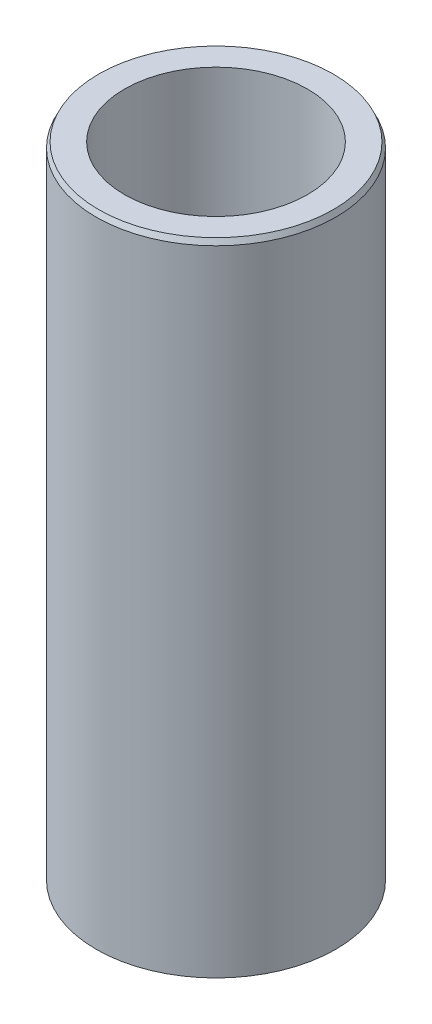
ISO-10303-21;
HEADER;
FILE_DESCRIPTION(('STEP AP214'),'2;1');
FILE_NAME('part.step','',(''),(''),'','','');
FILE_SCHEMA(('AUTOMOTIVE_DESIGN { 1 0 10303 214 1 1 1 1 }'));
ENDSEC;
DATA;
#1=APPLICATION_CONTEXT('core data for automotive mechanical design processes');
#2=APPLICATION_PROTOCOL_DEFINITION('international standard','automotive_design',2000,#1);
#3=PRODUCT_CONTEXT('',#1,'mechanical');
#4=PRODUCT('Part','Part','',(#3));
#5=PRODUCT_RELATED_PRODUCT_CATEGORY('part','',(#4));
#6=PRODUCT_DEFINITION_FORMATION('','',#4);
#7=PRODUCT_DEFINITION_CONTEXT('part definition',#1,'design');
#8=PRODUCT_DEFINITION('design','',#6,#7);
#9=PRODUCT_DEFINITION_SHAPE('','',#8);
#10=(LENGTH_UNIT() NAMED_UNIT(*) SI_UNIT(.MILLI.,.METRE.));
#11=(NAMED_UNIT(*) PLANE_ANGLE_UNIT() SI_UNIT($,.RADIAN.));
#12=(NAMED_UNIT(*) SI_UNIT($,.STERADIAN.) SOLID_ANGLE_UNIT());
#13=UNCERTAINTY_MEASURE_WITH_UNIT(LENGTH_MEASURE(1.E-05),#10,'distance_accuracy_value','');
#14=(GEOMETRIC_REPRESENTATION_CONTEXT(3) GLOBAL_UNCERTAINTY_ASSIGNED_CONTEXT((#13)) GLOBAL_UNIT_ASSIGNED_CONTEXT((#10,
#11,#12)) REPRESENTATION_CONTEXT('',''));
#15=CARTESIAN_POINT('',(0.,0.,0.));
#16=DIRECTION('',(0.,0.,1.));
#17=DIRECTION('',(1.,0.,0.));
#18=AXIS2_PLACEMENT_3D('',#15,#16,#17);
#19=CARTESIAN_POINT('',(0.,214.181819222892,0.));
#20=DIRECTION('',(0.,-1.,0.));
#21=DIRECTION('',(0.,0.,-1.));
#22=AXIS2_PLACEMENT_3D('',#19,#20,#21);
#23=CYLINDRICAL_SURFACE('',#22,40.);
#24=CARTESIAN_POINT('',(0.,212.414805123135,0.));
#25=DIRECTION('',(0.,1.,0.));
#26=DIRECTION('',(0.,0.,1.));
#27=AXIS2_PLACEMENT_3D('',#24,#25,#26);
#28=CIRCLE('',#27,40.);
#29=CARTESIAN_POINT('',(0.,212.414805123135,-40.));
#30=VERTEX_POINT('',#29);
#31=EDGE_CURVE('E50',#30,#30,#28,.F.);
#32=CARTESIAN_POINT('',(0.,0.837243441805524,0.));
#33=DIRECTION('',(0.,1.,0.));
#34=DIRECTION('',(0.,0.,1.));
#35=AXIS2_PLACEMENT_3D('',#32,#33,#34);
#36=CIRCLE('',#35,40.);
#37=CARTESIAN_POINT('',(0.,0.837243441805496,-40.));
#38=VERTEX_POINT('',#37);
#39=EDGE_CURVE('E51',#38,#38,#36,.T.);
#40=CARTESIAN_POINT('',(0.,212.414805123135,-40.));
#41=CARTESIAN_POINT('',(0.,210.210872188955,-40.));
#42=CARTESIAN_POINT('',(0.,208.006939254774,-40.));
#43=CARTESIAN_POINT('',(0.,203.599073386413,-40.));
#44=CARTESIAN_POINT('',(0.,201.395140452233,-40.));
#45=CARTESIAN_POINT('',(0.,196.987274583872,-40.));
#46=CARTESIAN_POINT('',(0.,194.783341649691,-40.));
#47=CARTESIAN_POINT('',(0.,190.37547578133,-40.));
#48=CARTESIAN_POINT('',(0.,188.17154284715,-40.));
#49=CARTESIAN_POINT('',(0.,183.763676978789,-40.));
#50=CARTESIAN_POINT('',(0.,181.559744044608,-40.));
#51=CARTESIAN_POINT('',(0.,177.151878176247,-40.));
#52=CARTESIAN_POINT('',(0.,174.947945242066,-40.));
#53=CARTESIAN_POINT('',(0.,170.540079373705,-40.));
#54=CARTESIAN_POINT('',(0.,168.336146439525,-40.));
#55=CARTESIAN_POINT('',(0.,163.928280571164,-40.));
#56=CARTESIAN_POINT('',(0.,161.724347636983,-40.));
#57=CARTESIAN_POINT('',(0.,157.316481768622,-40.));
#58=CARTESIAN_POINT('',(0.,155.112548834442,-40.));
#59=CARTESIAN_POINT('',(0.,150.704682966081,-40.));
#60=CARTESIAN_POINT('',(0.,148.5007500319,-40.));
#61=CARTESIAN_POINT('',(0.,144.092884163539,-40.));
#62=CARTESIAN_POINT('',(0.,141.888951229359,-40.));
#63=CARTESIAN_POINT('',(0.,137.481085360998,-40.));
#64=CARTESIAN_POINT('',(0.,135.277152426817,-40.));
#65=CARTESIAN_POINT('',(0.,130.869286558456,-40.));
#66=CARTESIAN_POINT('',(0.,128.665353624276,-40.));
#67=CARTESIAN_POINT('',(0.,124.257487755915,-40.));
#68=CARTESIAN_POINT('',(0.,122.053554821734,-40.));
#69=CARTESIAN_POINT('',(0.,117.645688953373,-40.));
#70=CARTESIAN_POINT('',(0.,115.441756019192,-40.));
#71=CARTESIAN_POINT('',(0.,111.033890150831,-40.));
#72=CARTESIAN_POINT('',(0.,108.829957216651,-40.));
#73=CARTESIAN_POINT('',(0.,104.42209134829,-40.));
#74=CARTESIAN_POINT('',(0.,102.218158414109,-40.));
#75=CARTESIAN_POINT('',(0.,97.8102925457483,-40.));
#76=CARTESIAN_POINT('',(0.,95.6063596115678,-40.));
#77=CARTESIAN_POINT('',(0.,91.1984937432068,-40.));
#78=CARTESIAN_POINT('',(0.,88.9945608090263,-40.));
#79=CARTESIAN_POINT('',(0.,84.5866949406652,-40.));
#80=CARTESIAN_POINT('',(0.,82.3827620064847,-40.));
#81=CARTESIAN_POINT('',(0.,77.9748961381236,-40.));
#82=CARTESIAN_POINT('',(0.,75.7709632039431,-40.));
#83=CARTESIAN_POINT('',(0.,71.3630973355821,-40.));
#84=CARTESIAN_POINT('',(0.,69.1591644014016,-40.));
#85=CARTESIAN_POINT('',(0.,64.7512985330405,-40.));
#86=CARTESIAN_POINT('',(0.,62.54736559886,-40.));
#87=CARTESIAN_POINT('',(0.,58.139499730499,-40.));
#88=CARTESIAN_POINT('',(0.,55.9355667963185,-40.));
#89=CARTESIAN_POINT('',(0.,51.5277009279574,-40.));
#90=CARTESIAN_POINT('',(0.,49.3237679937769,-40.));
#91=CARTESIAN_POINT('',(0.,44.9159021254158,-40.));
#92=CARTESIAN_POINT('',(0.,42.7119691912353,-40.));
#93=CARTESIAN_POINT('',(0.,38.3041033228743,-40.));
#94=CARTESIAN_POINT('',(0.,36.1001703886938,-40.));
#95=CARTESIAN_POINT('',(0.,31.6923045203328,-40.));
#96=CARTESIAN_POINT('',(0.,29.4883715861522,-40.));
#97=CARTESIAN_POINT('',(0.,25.0805057177912,-40.));
#98=CARTESIAN_POINT('',(0.,22.8765727836107,-40.));
#99=CARTESIAN_POINT('',(0.,18.4687069152496,-40.));
#100=CARTESIAN_POINT('',(0.,16.2647739810691,-40.));
#101=CARTESIAN_POINT('',(0.,11.8569081127081,-40.));
#102=CARTESIAN_POINT('',(0.,9.65297517852756,-40.));
#103=CARTESIAN_POINT('',(0.,5.24510931016652,-40.));
#104=CARTESIAN_POINT('',(0.,3.04117637598601,-40.));
#105=CARTESIAN_POINT('',(0.,0.837243441805496,-40.));
#106=B_SPLINE_CURVE_WITH_KNOTS('',3,(#40,#41,#42,#43,#44,#45,#46,#47,#48,#49,#50,#51,#52,#53,
#54,#55,#56,#57,#58,#59,#60,#61,#62,#63,#64,#65,#66,#67,#68,#69,#70,#71,#72,#73,#74,#75,#76,#77,
#78,#79,#80,#81,#82,#83,#84,#85,#86,#87,#88,#89,#90,#91,#92,#93,#94,#95,#96,#97,#98,#99,#100,
#101,#102,#103,#104,#105),.UNSPECIFIED.,.F.,.F.,(4,2,2,2,2,2,2,2,2,2,2,2,2,2,2,2,2,2,2,2,2,2,2,
2,2,2,2,2,2,2,2,2,4),(0.,6.61179880254154,13.2235976050831,19.8353964076247,26.4471952101662,
33.0589940127078,39.6707928152493,46.2825916177909,52.8943904203324,59.506189222874,
66.1179880254155,72.7297868279571,79.3415856304986,85.9533844330402,92.5651832355818,
99.1769820381233,105.788780840665,112.400579643206,119.012378445748,125.62417724829,
132.235976050831,138.847774853373,145.459573655914,152.071372458456,158.683171260997,
165.294970063539,171.90676886608,178.518567668622,185.130366471164,191.742165273705,
198.353964076247,204.965762878788,211.57756168133),.UNSPECIFIED.);
#107=EDGE_CURVE('BSEAM39',#30,#38,#106,.T.);
#108=ORIENTED_EDGE('',*,*,#31,.T.);
#109=ORIENTED_EDGE('',*,*,#39,.T.);
#110=ORIENTED_EDGE('',*,*,#107,.T.);
#111=ORIENTED_EDGE('',*,*,#107,.F.);
#112=EDGE_LOOP('',(#108,#110,#109,#111));
#113=FACE_BOUND('',#112,.T.);
#114=ADVANCED_FACE('F39',(#113),#23,.T.);
#115=CARTESIAN_POINT('',(0.,214.181819222892,0.));
#116=DIRECTION('',(0.,1.,0.));
#117=DIRECTION('',(0.,0.,1.));
#118=AXIS2_PLACEMENT_3D('',#115,#116,#117);
#119=PLANE('',#118);
#120=CARTESIAN_POINT('',(0.,214.181819222892,0.));
#121=DIRECTION('',(0.,1.,0.));
#122=DIRECTION('',(0.,0.,1.));
#123=AXIS2_PLACEMENT_3D('',#120,#121,#122);
#124=CIRCLE('',#123,39.1627565581945);
#125=CARTESIAN_POINT('',(0.,214.181819222892,-39.1627565581945));
#126=VERTEX_POINT('',#125);
#127=EDGE_CURVE('E54',#126,#126,#124,.T.);
#128=ORIENTED_EDGE('',*,*,#127,.T.);
#129=EDGE_LOOP('',(#128));
#130=FACE_BOUND('',#129,.T.);
#131=CARTESIAN_POINT('',(0.,214.181819222892,0.));
#132=DIRECTION('',(0.,1.,0.));
#133=DIRECTION('',(0.,0.,1.));
#134=AXIS2_PLACEMENT_3D('',#131,#132,#133);
#135=CIRCLE('',#134,30.5337152752213);
#136=CARTESIAN_POINT('',(0.,214.181819222892,30.5337152752213));
#137=VERTEX_POINT('',#136);
#138=EDGE_CURVE('E58',#137,#137,#135,.T.);
#139=ORIENTED_EDGE('',*,*,#138,.F.);
#140=EDGE_LOOP('',(#139));
#141=FACE_BOUND('',#140,.T.);
#142=ADVANCED_FACE('F69',(#130,#141),#119,.T.);
#143=CARTESIAN_POINT('',(0.,0.,0.));
#144=DIRECTION('',(0.,1.,0.));
#145=DIRECTION('',(0.,0.,1.));
#146=AXIS2_PLACEMENT_3D('',#143,#144,#145);
#147=PLANE('',#146);
#148=CARTESIAN_POINT('',(0.,0.,0.));
#149=DIRECTION('',(0.,1.,0.));
#150=DIRECTION('',(0.,0.,1.));
#151=AXIS2_PLACEMENT_3D('',#148,#149,#150);
#152=CIRCLE('',#151,38.2329859002427);
#153=CARTESIAN_POINT('',(0.,0.,38.2329859002427));
#154=VERTEX_POINT('',#153);
#155=EDGE_CURVE('E10',#154,#154,#152,.F.);
#156=ORIENTED_EDGE('',*,*,#155,.T.);
#157=EDGE_LOOP('',(#156));
#158=FACE_BOUND('',#157,.T.);
#159=CARTESIAN_POINT('',(0.,0.,0.));
#160=DIRECTION('',(0.,1.,0.));
#161=DIRECTION('',(0.,0.,1.));
#162=AXIS2_PLACEMENT_3D('',#159,#160,#161);
#163=CIRCLE('',#162,30.5337152752213);
#164=CARTESIAN_POINT('',(0.,0.,30.5337152752213));
#165=VERTEX_POINT('',#164);
#166=EDGE_CURVE('E63',#165,#165,#163,.T.);
#167=ORIENTED_EDGE('',*,*,#166,.T.);
#168=EDGE_LOOP('',(#167));
#169=FACE_BOUND('',#168,.T.);
#170=ADVANCED_FACE('F75',(#158,#169),#147,.F.);
#171=CARTESIAN_POINT('',(0.,214.181819222892,0.));
#172=DIRECTION('',(0.,-1.,0.));
#173=DIRECTION('',(0.,0.,-1.));
#174=AXIS2_PLACEMENT_3D('',#171,#172,#173);
#175=CYLINDRICAL_SURFACE('',#174,30.5337152752213);
#176=ORIENTED_EDGE('',*,*,#138,.T.);
#177=EDGE_LOOP('',(#176));
#178=FACE_BOUND('',#177,.T.);
#179=ORIENTED_EDGE('',*,*,#166,.F.);
#180=EDGE_LOOP('',(#179));
#181=FACE_BOUND('',#180,.T.);
#182=ADVANCED_FACE('F70',(#178,#181),#175,.F.);
#183=CARTESIAN_POINT('',(0.,214.181819222892,0.));
#184=DIRECTION('',(0.,-1.,0.));
#185=DIRECTION('',(0.,0.,-1.));
#186=AXIS2_PLACEMENT_3D('',#183,#184,#185);
#187=CONICAL_SURFACE('',#186,39.1627565581945,0.442483652923637);
#188=CARTESIAN_POINT('',(0.,212.414805123135,-40.));
#189=CARTESIAN_POINT('',(0.,212.433211520008,-39.9912787141479));
#190=CARTESIAN_POINT('',(0.,212.45161791688,-39.9825574282957));
#191=CARTESIAN_POINT('',(0.,212.488430710625,-39.9651148565914));
#192=CARTESIAN_POINT('',(0.,212.506837107498,-39.9563935707393));
#193=CARTESIAN_POINT('',(0.,212.543649901243,-39.938950999035));
#194=CARTESIAN_POINT('',(0.,212.562056298115,-39.9302297131829));
#195=CARTESIAN_POINT('',(0.,212.59886909186,-39.9127871414786));
#196=CARTESIAN_POINT('',(0.,212.617275488732,-39.9040658556265));
#197=CARTESIAN_POINT('',(0.,212.654088282477,-39.8866232839222));
#198=CARTESIAN_POINT('',(0.,212.67249467935,-39.87790199807));
#199=CARTESIAN_POINT('',(0.,212.709307473095,-39.8604594263658));
#200=CARTESIAN_POINT('',(0.,212.727713869967,-39.8517381405136));
#201=CARTESIAN_POINT('',(0.,212.764526663712,-39.8342955688093));
#202=CARTESIAN_POINT('',(0.,212.782933060585,-39.8255742829572));
#203=CARTESIAN_POINT('',(0.,212.81974585433,-39.8081317112529));
#204=CARTESIAN_POINT('',(0.,212.838152251202,-39.7994104254008));
#205=CARTESIAN_POINT('',(0.,212.874965044947,-39.7819678536965));
#206=CARTESIAN_POINT('',(0.,212.89337144182,-39.7732465678444));
#207=CARTESIAN_POINT('',(0.,212.930184235564,-39.7558039961401));
#208=CARTESIAN_POINT('',(0.,212.948590632437,-39.7470827102879));
#209=CARTESIAN_POINT('',(0.,212.985403426182,-39.7296401385837));
#210=CARTESIAN_POINT('',(0.,213.003809823054,-39.7209188527315));
#211=CARTESIAN_POINT('',(0.,213.040622616799,-39.7034762810272));
#212=CARTESIAN_POINT('',(0.,213.059029013672,-39.6947549951751));
#213=CARTESIAN_POINT('',(0.,213.095841807417,-39.6773124234708));
#214=CARTESIAN_POINT('',(0.,213.114248204289,-39.6685911376187));
#215=CARTESIAN_POINT('',(0.,213.151060998034,-39.6511485659144));
#216=CARTESIAN_POINT('',(0.,213.169467394907,-39.6424272800623));
#217=CARTESIAN_POINT('',(0.,213.206280188652,-39.624984708358));
#218=CARTESIAN_POINT('',(0.,213.224686585524,-39.6162634225058));
#219=CARTESIAN_POINT('',(0.,213.261499379269,-39.5988208508015));
#220=CARTESIAN_POINT('',(0.,213.279905776141,-39.5900995649494));
#221=CARTESIAN_POINT('',(0.,213.316718569886,-39.5726569932451));
#222=CARTESIAN_POINT('',(0.,213.335124966759,-39.563935707393));
#223=CARTESIAN_POINT('',(0.,213.371937760504,-39.5464931356887));
#224=CARTESIAN_POINT('',(0.,213.390344157376,-39.5377718498366));
#225=CARTESIAN_POINT('',(0.,213.427156951121,-39.5203292781323));
#226=CARTESIAN_POINT('',(0.,213.445563347994,-39.5116079922801));
#227=CARTESIAN_POINT('',(0.,213.482376141739,-39.4941654205759));
#228=CARTESIAN_POINT('',(0.,213.500782538611,-39.4854441347237));
#229=CARTESIAN_POINT('',(0.,213.537595332356,-39.4680015630194));
#230=CARTESIAN_POINT('',(0.,213.556001729228,-39.4592802771673));
#231=CARTESIAN_POINT('',(0.,213.592814522973,-39.441837705463));
#232=CARTESIAN_POINT('',(0.,213.611220919846,-39.4331164196109));
#233=CARTESIAN_POINT('',(0.,213.648033713591,-39.4156738479066));
#234=CARTESIAN_POINT('',(0.,213.666440110463,-39.4069525620545));
#235=CARTESIAN_POINT('',(0.,213.703252904208,-39.3895099903502));
#236=CARTESIAN_POINT('',(0.,213.721659301081,-39.380788704498));
#237=CARTESIAN_POINT('',(0.,213.758472094826,-39.3633461327938));
#238=CARTESIAN_POINT('',(0.,213.776878491698,-39.3546248469416));
#239=CARTESIAN_POINT('',(0.,213.813691285443,-39.3371822752373));
#240=CARTESIAN_POINT('',(0.,213.832097682316,-39.3284609893852));
#241=CARTESIAN_POINT('',(0.,213.86891047606,-39.3110184176809));
#242=CARTESIAN_POINT('',(0.,213.887316872933,-39.3022971318288));
#243=CARTESIAN_POINT('',(0.,213.924129666678,-39.2848545601245));
#244=CARTESIAN_POINT('',(0.,213.94253606355,-39.2761332742724));
#245=CARTESIAN_POINT('',(0.,213.979348857295,-39.2586907025681));
#246=CARTESIAN_POINT('',(0.,213.997755254168,-39.2499694167159));
#247=CARTESIAN_POINT('',(0.,214.034568047913,-39.2325268450117));
#248=CARTESIAN_POINT('',(0.,214.052974444785,-39.2238055591595));
#249=CARTESIAN_POINT('',(0.,214.08978723853,-39.2063629874552));
#250=CARTESIAN_POINT('',(0.,214.108193635403,-39.1976417016031));
#251=CARTESIAN_POINT('',(0.,214.145006429148,-39.1801991298988));
#252=CARTESIAN_POINT('',(0.,214.16341282602,-39.1714778440467));
#253=CARTESIAN_POINT('',(0.,214.181819222892,-39.1627565581945));
#254=B_SPLINE_CURVE_WITH_KNOTS('',3,(#188,#189,#190,#191,#192,#193,#194,#195,#196,#197,#198,
#199,#200,#201,#202,#203,#204,#205,#206,#207,#208,#209,#210,#211,#212,#213,#214,#215,#216,#217,
#218,#219,#220,#221,#222,#223,#224,#225,#226,#227,#228,#229,#230,#231,#232,#233,#234,#235,#236,
#237,#238,#239,#240,#241,#242,#243,#244,#245,#246,#247,#248,#249,#250,#251,#252,#253),
.UNSPECIFIED.,.F.,.F.,(4,2,2,2,2,2,2,2,2,2,2,2,2,2,2,2,2,2,2,2,2,2,2,2,2,2,2,2,2,2,2,2,4),(0.,
0.0611040625054855,0.122208125010968,0.183312187516454,0.244416250021961,0.305520312527447,
0.366624375032929,0.427728437538415,0.488832500043923,0.549936562549408,0.611040625054891,
0.672144687560376,0.733248750065884,0.794352812571369,0.855456875076852,0.916560937582338,
0.977665000087848,1.03876906259333,1.09987312509882,1.1609771876043,1.22208125010981,
1.28318531261529,1.34428937512078,1.40539343762626,1.46649750013177,1.52760156263725,
1.58870562514274,1.64980968764822,1.71091375015373,1.77201781265921,1.8331218751647,
1.89422593767019,1.95533000017569),.UNSPECIFIED.);
#255=EDGE_CURVE('BSEAM81',#30,#126,#254,.T.);
#256=ORIENTED_EDGE('',*,*,#31,.F.);
#257=ORIENTED_EDGE('',*,*,#127,.F.);
#258=ORIENTED_EDGE('',*,*,#255,.T.);
#259=ORIENTED_EDGE('',*,*,#255,.F.);
#260=EDGE_LOOP('',(#256,#258,#257,#259));
#261=FACE_BOUND('',#260,.T.);
#262=ADVANCED_FACE('F81',(#261),#187,.T.);
#263=CARTESIAN_POINT('',(0.,0.837243441805524,0.));
#264=DIRECTION('',(0.,1.,0.));
#265=DIRECTION('',(0.,0.,1.));
#266=AXIS2_PLACEMENT_3D('',#263,#264,#265);
#267=CONICAL_SURFACE('',#266,40.,1.12831267387126);
#268=ORIENTED_EDGE('',*,*,#155,.F.);
#269=EDGE_LOOP('',(#268));
#270=FACE_BOUND('',#269,.T.);
#271=ORIENTED_EDGE('',*,*,#39,.F.);
#272=EDGE_LOOP('',(#271));
#273=FACE_BOUND('',#272,.T.);
#274=ADVANCED_FACE('F45',(#270,#273),#267,.T.);
#275=CLOSED_SHELL('',(#114,#142,#170,#182,#262,#274));
#276=MANIFOLD_SOLID_BREP('B2',#275);
#277=ADVANCED_BREP_SHAPE_REPRESENTATION('',(#18,#276),#14);
#278=SHAPE_DEFINITION_REPRESENTATION(#9,#277);
ENDSEC;
END-ISO-10303-21;
